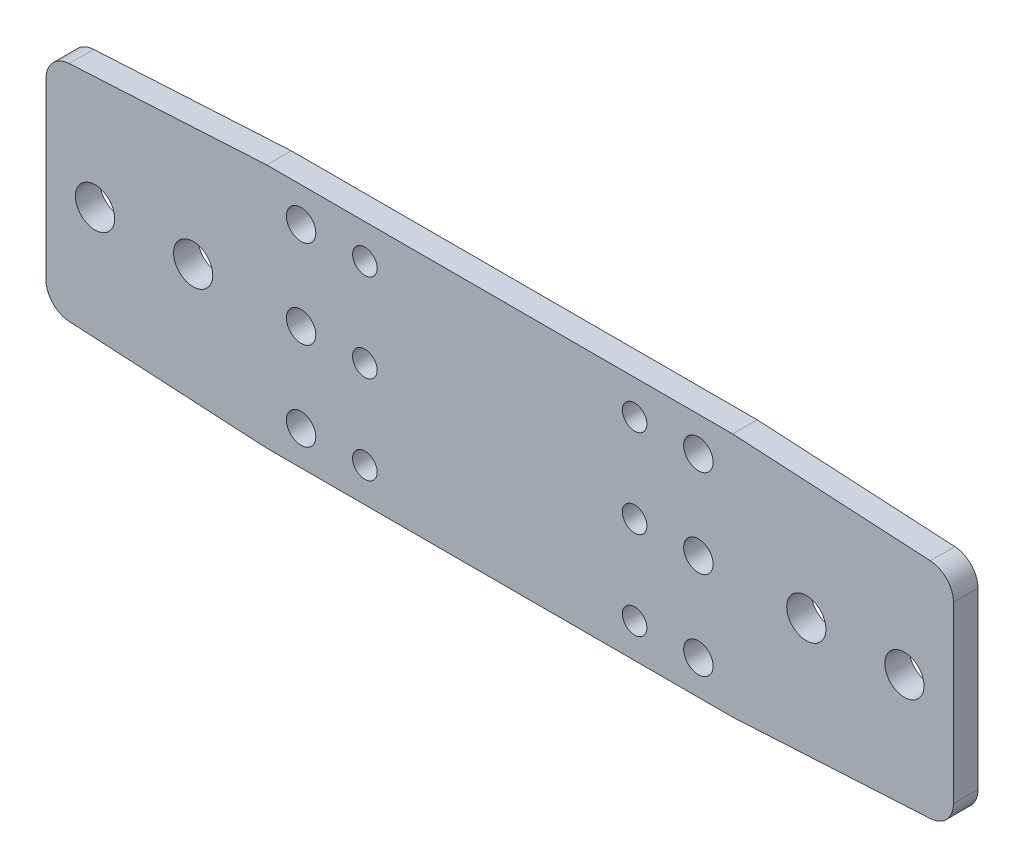
ISO-10303-21;
HEADER;
FILE_DESCRIPTION(('STEP AP214'),'2;1');
FILE_NAME('part.step','',(''),(''),'','','');
FILE_SCHEMA(('AUTOMOTIVE_DESIGN { 1 0 10303 214 1 1 1 1 }'));
ENDSEC;
DATA;
#1=APPLICATION_CONTEXT('core data for automotive mechanical design processes');
#2=APPLICATION_PROTOCOL_DEFINITION('international standard','automotive_design',2000,#1);
#3=PRODUCT_CONTEXT('',#1,'mechanical');
#4=PRODUCT('Part','Part','',(#3));
#5=PRODUCT_RELATED_PRODUCT_CATEGORY('part','',(#4));
#6=PRODUCT_DEFINITION_FORMATION('','',#4);
#7=PRODUCT_DEFINITION_CONTEXT('part definition',#1,'design');
#8=PRODUCT_DEFINITION('design','',#6,#7);
#9=PRODUCT_DEFINITION_SHAPE('','',#8);
#10=(LENGTH_UNIT() NAMED_UNIT(*) SI_UNIT(.MILLI.,.METRE.));
#11=(NAMED_UNIT(*) PLANE_ANGLE_UNIT() SI_UNIT($,.RADIAN.));
#12=(NAMED_UNIT(*) SI_UNIT($,.STERADIAN.) SOLID_ANGLE_UNIT());
#13=UNCERTAINTY_MEASURE_WITH_UNIT(LENGTH_MEASURE(1.E-05),#10,'distance_accuracy_value','');
#14=(GEOMETRIC_REPRESENTATION_CONTEXT(3) GLOBAL_UNCERTAINTY_ASSIGNED_CONTEXT((#13)) GLOBAL_UNIT_ASSIGNED_CONTEXT((#10,
#11,#12)) REPRESENTATION_CONTEXT('',''));
#15=CARTESIAN_POINT('',(0.,0.,0.));
#16=DIRECTION('',(0.,0.,1.));
#17=DIRECTION('',(1.,0.,0.));
#18=AXIS2_PLACEMENT_3D('',#15,#16,#17);
#19=CARTESIAN_POINT('',(0.,0.,5.));
#20=DIRECTION('',(0.,0.,-1.));
#21=DIRECTION('',(-1.,0.,0.));
#22=AXIS2_PLACEMENT_3D('',#19,#20,#21);
#23=PLANE('',#22);
#24=DIRECTION('',(0.,1.,0.));
#25=VECTOR('',#24,1.);
#26=CARTESIAN_POINT('',(140.,-47.5,5.));
#27=LINE('',#26,#25);
#28=CARTESIAN_POINT('',(140.,-42.7700676729667,5.));
#29=VERTEX_POINT('',#28);
#30=CARTESIAN_POINT('',(140.,-7.22993232703332,5.));
#31=VERTEX_POINT('',#30);
#32=EDGE_CURVE('E230',#29,#31,#27,.T.);
#33=ORIENTED_EDGE('',*,*,#32,.T.);
#34=CARTESIAN_POINT('',(135.,-7.22993232703331,5.));
#35=DIRECTION('',(0.,0.,-1.));
#36=DIRECTION('',(-1.,0.,0.));
#37=AXIS2_PLACEMENT_3D('',#34,#35,#36);
#38=CIRCLE('',#37,5.);
#39=CARTESIAN_POINT('',(135.277350098113,-2.23763056100624,5.));
#40=VERTEX_POINT('',#39);
#41=EDGE_CURVE('E141',#31,#40,#38,.F.);
#42=ORIENTED_EDGE('',*,*,#41,.T.);
#43=DIRECTION('',(-0.998460353205412,0.0554700196225229,0.));
#44=VECTOR('',#43,1.);
#45=CARTESIAN_POINT('',(140.,-2.49999999999999,5.));
#46=LINE('',#45,#44);
#47=CARTESIAN_POINT('',(95.,0.,5.));
#48=VERTEX_POINT('',#47);
#49=EDGE_CURVE('E133',#40,#48,#46,.T.);
#50=ORIENTED_EDGE('',*,*,#49,.T.);
#51=DIRECTION('',(-1.,0.,0.));
#52=VECTOR('',#51,1.);
#53=CARTESIAN_POINT('',(95.,0.,5.));
#54=LINE('',#53,#52);
#55=CARTESIAN_POINT('',(0.,0.,5.));
#56=VERTEX_POINT('',#55);
#57=EDGE_CURVE('E138',#48,#56,#54,.T.);
#58=ORIENTED_EDGE('',*,*,#57,.T.);
#59=DIRECTION('',(-0.998460353205412,-0.0554700196225231,0.));
#60=VECTOR('',#59,1.);
#61=CARTESIAN_POINT('',(-45.,-2.50000000000001,5.));
#62=LINE('',#61,#60);
#63=CARTESIAN_POINT('',(-40.2773500981126,-2.23763056100626,5.));
#64=VERTEX_POINT('',#63);
#65=EDGE_CURVE('E155',#56,#64,#62,.T.);
#66=ORIENTED_EDGE('',*,*,#65,.T.);
#67=CARTESIAN_POINT('',(-40.,-7.22993232703333,5.));
#68=DIRECTION('',(0.,0.,-1.));
#69=DIRECTION('',(-1.,0.,0.));
#70=AXIS2_PLACEMENT_3D('',#67,#68,#69);
#71=CIRCLE('',#70,5.);
#72=CARTESIAN_POINT('',(-45.,-7.22993232703334,5.));
#73=VERTEX_POINT('',#72);
#74=EDGE_CURVE('E182',#64,#73,#71,.F.);
#75=ORIENTED_EDGE('',*,*,#74,.T.);
#76=DIRECTION('',(0.,-1.,0.));
#77=VECTOR('',#76,1.);
#78=CARTESIAN_POINT('',(-45.,-47.5,5.));
#79=LINE('',#78,#77);
#80=CARTESIAN_POINT('',(-45.,-42.7700676729667,5.));
#81=VERTEX_POINT('',#80);
#82=EDGE_CURVE('E201',#73,#81,#79,.T.);
#83=ORIENTED_EDGE('',*,*,#82,.T.);
#84=CARTESIAN_POINT('',(-40.,-42.7700676729667,5.));
#85=DIRECTION('',(0.,0.,-1.));
#86=DIRECTION('',(-1.,0.,0.));
#87=AXIS2_PLACEMENT_3D('',#84,#85,#86);
#88=CIRCLE('',#87,5.);
#89=CARTESIAN_POINT('',(-40.2773500981126,-47.7623694389937,5.));
#90=VERTEX_POINT('',#89);
#91=EDGE_CURVE('E66',#81,#90,#88,.F.);
#92=ORIENTED_EDGE('',*,*,#91,.T.);
#93=DIRECTION('',(0.998460353205412,-0.055470019622523,0.));
#94=VECTOR('',#93,1.);
#95=CARTESIAN_POINT('',(-45.,-47.5,5.));
#96=LINE('',#95,#94);
#97=CARTESIAN_POINT('',(0.,-50.,5.));
#98=VERTEX_POINT('',#97);
#99=EDGE_CURVE('E522',#90,#98,#96,.T.);
#100=ORIENTED_EDGE('',*,*,#99,.T.);
#101=DIRECTION('',(1.,0.,0.));
#102=VECTOR('',#101,1.);
#103=CARTESIAN_POINT('',(0.,-50.,5.));
#104=LINE('',#103,#102);
#105=CARTESIAN_POINT('',(95.,-50.,5.));
#106=VERTEX_POINT('',#105);
#107=EDGE_CURVE('E238',#98,#106,#104,.T.);
#108=ORIENTED_EDGE('',*,*,#107,.T.);
#109=DIRECTION('',(0.998460353205412,0.0554700196225236,0.));
#110=VECTOR('',#109,1.);
#111=CARTESIAN_POINT('',(140.,-47.5,5.));
#112=LINE('',#111,#110);
#113=CARTESIAN_POINT('',(135.277350098113,-47.7623694389937,5.));
#114=VERTEX_POINT('',#113);
#115=EDGE_CURVE('E248',#106,#114,#112,.T.);
#116=ORIENTED_EDGE('',*,*,#115,.T.);
#117=CARTESIAN_POINT('',(135.,-42.7700676729667,5.));
#118=DIRECTION('',(0.,0.,-1.));
#119=DIRECTION('',(-1.,0.,0.));
#120=AXIS2_PLACEMENT_3D('',#117,#118,#119);
#121=CIRCLE('',#120,5.);
#122=EDGE_CURVE('E184',#114,#29,#121,.F.);
#123=ORIENTED_EDGE('',*,*,#122,.T.);
#124=EDGE_LOOP('',(#33,#42,#50,#58,#66,#75,#83,#92,#100,#108,#116,#123));
#125=FACE_BOUND('',#124,.T.);
#126=CARTESIAN_POINT('',(7.,-43.,5.));
#127=DIRECTION('',(0.,0.,1.));
#128=DIRECTION('',(1.,0.,0.));
#129=AXIS2_PLACEMENT_3D('',#126,#127,#128);
#130=CIRCLE('',#129,3.);
#131=CARTESIAN_POINT('',(10.,-43.,5.));
#132=VERTEX_POINT('',#131);
#133=EDGE_CURVE('E256',#132,#132,#130,.T.);
#134=ORIENTED_EDGE('',*,*,#133,.F.);
#135=EDGE_LOOP('',(#134));
#136=FACE_BOUND('',#135,.T.);
#137=CARTESIAN_POINT('',(7.,-25.,5.));
#138=DIRECTION('',(0.,0.,1.));
#139=DIRECTION('',(1.,0.,0.));
#140=AXIS2_PLACEMENT_3D('',#137,#138,#139);
#141=CIRCLE('',#140,3.);
#142=CARTESIAN_POINT('',(10.,-25.,5.));
#143=VERTEX_POINT('',#142);
#144=EDGE_CURVE('E529',#143,#143,#141,.T.);
#145=ORIENTED_EDGE('',*,*,#144,.F.);
#146=EDGE_LOOP('',(#145));
#147=FACE_BOUND('',#146,.T.);
#148=CARTESIAN_POINT('',(88.,-43.,5.));
#149=DIRECTION('',(0.,0.,1.));
#150=DIRECTION('',(1.,0.,0.));
#151=AXIS2_PLACEMENT_3D('',#148,#149,#150);
#152=CIRCLE('',#151,3.);
#153=CARTESIAN_POINT('',(91.,-43.,5.));
#154=VERTEX_POINT('',#153);
#155=EDGE_CURVE('E535',#154,#154,#152,.T.);
#156=ORIENTED_EDGE('',*,*,#155,.F.);
#157=EDGE_LOOP('',(#156));
#158=FACE_BOUND('',#157,.T.);
#159=CARTESIAN_POINT('',(88.,-7.,5.));
#160=DIRECTION('',(0.,0.,1.));
#161=DIRECTION('',(1.,0.,0.));
#162=AXIS2_PLACEMENT_3D('',#159,#160,#161);
#163=CIRCLE('',#162,3.);
#164=CARTESIAN_POINT('',(91.,-7.,5.));
#165=VERTEX_POINT('',#164);
#166=EDGE_CURVE('E541',#165,#165,#163,.T.);
#167=ORIENTED_EDGE('',*,*,#166,.F.);
#168=EDGE_LOOP('',(#167));
#169=FACE_BOUND('',#168,.T.);
#170=CARTESIAN_POINT('',(88.,-25.,5.));
#171=DIRECTION('',(0.,0.,1.));
#172=DIRECTION('',(1.,0.,0.));
#173=AXIS2_PLACEMENT_3D('',#170,#171,#172);
#174=CIRCLE('',#173,3.00000000000001);
#175=CARTESIAN_POINT('',(91.,-25.,5.));
#176=VERTEX_POINT('',#175);
#177=EDGE_CURVE('E547',#176,#176,#174,.T.);
#178=ORIENTED_EDGE('',*,*,#177,.F.);
#179=EDGE_LOOP('',(#178));
#180=FACE_BOUND('',#179,.T.);
#181=CARTESIAN_POINT('',(7.,-7.,5.));
#182=DIRECTION('',(0.,0.,1.));
#183=DIRECTION('',(1.,0.,0.));
#184=AXIS2_PLACEMENT_3D('',#181,#182,#183);
#185=CIRCLE('',#184,3.);
#186=CARTESIAN_POINT('',(10.,-7.,5.));
#187=VERTEX_POINT('',#186);
#188=EDGE_CURVE('E553',#187,#187,#185,.T.);
#189=ORIENTED_EDGE('',*,*,#188,.F.);
#190=EDGE_LOOP('',(#189));
#191=FACE_BOUND('',#190,.T.);
#192=CARTESIAN_POINT('',(20.,-7.,5.));
#193=DIRECTION('',(0.,0.,1.));
#194=DIRECTION('',(1.,0.,0.));
#195=AXIS2_PLACEMENT_3D('',#192,#193,#194);
#196=CIRCLE('',#195,2.5);
#197=CARTESIAN_POINT('',(22.5,-7.,5.));
#198=VERTEX_POINT('',#197);
#199=EDGE_CURVE('E559',#198,#198,#196,.T.);
#200=ORIENTED_EDGE('',*,*,#199,.F.);
#201=EDGE_LOOP('',(#200));
#202=FACE_BOUND('',#201,.T.);
#203=CARTESIAN_POINT('',(20.,-43.,5.));
#204=DIRECTION('',(0.,0.,1.));
#205=DIRECTION('',(1.,0.,0.));
#206=AXIS2_PLACEMENT_3D('',#203,#204,#205);
#207=CIRCLE('',#206,2.5);
#208=CARTESIAN_POINT('',(22.5,-43.,5.));
#209=VERTEX_POINT('',#208);
#210=EDGE_CURVE('E565',#209,#209,#207,.T.);
#211=ORIENTED_EDGE('',*,*,#210,.F.);
#212=EDGE_LOOP('',(#211));
#213=FACE_BOUND('',#212,.T.);
#214=CARTESIAN_POINT('',(-35.,-25.,5.));
#215=DIRECTION('',(0.,0.,1.));
#216=DIRECTION('',(1.,0.,0.));
#217=AXIS2_PLACEMENT_3D('',#214,#215,#216);
#218=CIRCLE('',#217,4.);
#219=CARTESIAN_POINT('',(-31.,-25.,5.));
#220=VERTEX_POINT('',#219);
#221=EDGE_CURVE('E571',#220,#220,#218,.T.);
#222=ORIENTED_EDGE('',*,*,#221,.F.);
#223=EDGE_LOOP('',(#222));
#224=FACE_BOUND('',#223,.T.);
#225=CARTESIAN_POINT('',(-15.,-25.,5.));
#226=DIRECTION('',(0.,0.,1.));
#227=DIRECTION('',(1.,0.,0.));
#228=AXIS2_PLACEMENT_3D('',#225,#226,#227);
#229=CIRCLE('',#228,4.);
#230=CARTESIAN_POINT('',(-11.,-25.,5.));
#231=VERTEX_POINT('',#230);
#232=EDGE_CURVE('E577',#231,#231,#229,.T.);
#233=ORIENTED_EDGE('',*,*,#232,.F.);
#234=EDGE_LOOP('',(#233));
#235=FACE_BOUND('',#234,.T.);
#236=CARTESIAN_POINT('',(75.,-43.,5.));
#237=DIRECTION('',(0.,0.,1.));
#238=DIRECTION('',(-1.,0.,0.));
#239=AXIS2_PLACEMENT_3D('',#236,#237,#238);
#240=CIRCLE('',#239,2.5);
#241=CARTESIAN_POINT('',(72.5,-43.,5.));
#242=VERTEX_POINT('',#241);
#243=EDGE_CURVE('E583',#242,#242,#240,.T.);
#244=ORIENTED_EDGE('',*,*,#243,.F.);
#245=EDGE_LOOP('',(#244));
#246=FACE_BOUND('',#245,.T.);
#247=CARTESIAN_POINT('',(75.,-7.00000000000001,5.));
#248=DIRECTION('',(0.,0.,1.));
#249=DIRECTION('',(-1.,0.,0.));
#250=AXIS2_PLACEMENT_3D('',#247,#248,#249);
#251=CIRCLE('',#250,2.49999999999999);
#252=CARTESIAN_POINT('',(72.5,-7.00000000000001,5.));
#253=VERTEX_POINT('',#252);
#254=EDGE_CURVE('E589',#253,#253,#251,.T.);
#255=ORIENTED_EDGE('',*,*,#254,.F.);
#256=EDGE_LOOP('',(#255));
#257=FACE_BOUND('',#256,.T.);
#258=CARTESIAN_POINT('',(110.,-25.,5.));
#259=DIRECTION('',(0.,0.,1.));
#260=DIRECTION('',(-1.,0.,0.));
#261=AXIS2_PLACEMENT_3D('',#258,#259,#260);
#262=CIRCLE('',#261,4.00000000000002);
#263=CARTESIAN_POINT('',(106.,-25.,5.));
#264=VERTEX_POINT('',#263);
#265=EDGE_CURVE('E595',#264,#264,#262,.T.);
#266=ORIENTED_EDGE('',*,*,#265,.F.);
#267=EDGE_LOOP('',(#266));
#268=FACE_BOUND('',#267,.T.);
#269=CARTESIAN_POINT('',(130.,-25.,5.));
#270=DIRECTION('',(0.,0.,1.));
#271=DIRECTION('',(-1.,0.,0.));
#272=AXIS2_PLACEMENT_3D('',#269,#270,#271);
#273=CIRCLE('',#272,3.99999999999999);
#274=CARTESIAN_POINT('',(126.,-25.,5.));
#275=VERTEX_POINT('',#274);
#276=EDGE_CURVE('E601',#275,#275,#273,.T.);
#277=ORIENTED_EDGE('',*,*,#276,.F.);
#278=EDGE_LOOP('',(#277));
#279=FACE_BOUND('',#278,.T.);
#280=CARTESIAN_POINT('',(20.,-25.,5.));
#281=DIRECTION('',(0.,0.,1.));
#282=DIRECTION('',(1.,0.,0.));
#283=AXIS2_PLACEMENT_3D('',#280,#281,#282);
#284=CIRCLE('',#283,2.5);
#285=CARTESIAN_POINT('',(22.5,-25.,5.));
#286=VERTEX_POINT('',#285);
#287=EDGE_CURVE('E607',#286,#286,#284,.T.);
#288=ORIENTED_EDGE('',*,*,#287,.F.);
#289=EDGE_LOOP('',(#288));
#290=FACE_BOUND('',#289,.T.);
#291=CARTESIAN_POINT('',(75.,-25.,5.));
#292=DIRECTION('',(0.,0.,1.));
#293=DIRECTION('',(1.,0.,0.));
#294=AXIS2_PLACEMENT_3D('',#291,#292,#293);
#295=CIRCLE('',#294,2.50000000000001);
#296=CARTESIAN_POINT('',(77.5,-25.,5.));
#297=VERTEX_POINT('',#296);
#298=EDGE_CURVE('E613',#297,#297,#295,.T.);
#299=ORIENTED_EDGE('',*,*,#298,.F.);
#300=EDGE_LOOP('',(#299));
#301=FACE_BOUND('',#300,.T.);
#302=ADVANCED_FACE('F43',(#125,#136,#147,#158,#169,#180,#191,#202,#213,#224,#235,#246,#257,#268,
#279,#290,#301),#23,.F.);
#303=CARTESIAN_POINT('',(0.,0.,0.));
#304=DIRECTION('',(0.,0.,-1.));
#305=DIRECTION('',(-1.,0.,0.));
#306=AXIS2_PLACEMENT_3D('',#303,#304,#305);
#307=PLANE('',#306);
#308=CARTESIAN_POINT('',(20.,-25.,0.));
#309=DIRECTION('',(0.,0.,1.));
#310=DIRECTION('',(1.,0.,0.));
#311=AXIS2_PLACEMENT_3D('',#308,#309,#310);
#312=CIRCLE('',#311,2.5);
#313=CARTESIAN_POINT('',(22.5,-25.,0.));
#314=VERTEX_POINT('',#313);
#315=EDGE_CURVE('E610',#314,#314,#312,.T.);
#316=ORIENTED_EDGE('',*,*,#315,.T.);
#317=EDGE_LOOP('',(#316));
#318=FACE_BOUND('',#317,.T.);
#319=CARTESIAN_POINT('',(110.,-25.,0.));
#320=DIRECTION('',(0.,0.,1.));
#321=DIRECTION('',(-1.,0.,0.));
#322=AXIS2_PLACEMENT_3D('',#319,#320,#321);
#323=CIRCLE('',#322,4.00000000000002);
#324=CARTESIAN_POINT('',(106.,-25.,0.));
#325=VERTEX_POINT('',#324);
#326=EDGE_CURVE('E598',#325,#325,#323,.T.);
#327=ORIENTED_EDGE('',*,*,#326,.T.);
#328=EDGE_LOOP('',(#327));
#329=FACE_BOUND('',#328,.T.);
#330=CARTESIAN_POINT('',(75.,-43.,0.));
#331=DIRECTION('',(0.,0.,1.));
#332=DIRECTION('',(-1.,0.,0.));
#333=AXIS2_PLACEMENT_3D('',#330,#331,#332);
#334=CIRCLE('',#333,2.5);
#335=CARTESIAN_POINT('',(72.5,-43.,0.));
#336=VERTEX_POINT('',#335);
#337=EDGE_CURVE('E586',#336,#336,#334,.T.);
#338=ORIENTED_EDGE('',*,*,#337,.T.);
#339=EDGE_LOOP('',(#338));
#340=FACE_BOUND('',#339,.T.);
#341=CARTESIAN_POINT('',(-35.,-25.,0.));
#342=DIRECTION('',(0.,0.,1.));
#343=DIRECTION('',(1.,0.,0.));
#344=AXIS2_PLACEMENT_3D('',#341,#342,#343);
#345=CIRCLE('',#344,4.);
#346=CARTESIAN_POINT('',(-31.,-25.,0.));
#347=VERTEX_POINT('',#346);
#348=EDGE_CURVE('E574',#347,#347,#345,.T.);
#349=ORIENTED_EDGE('',*,*,#348,.T.);
#350=EDGE_LOOP('',(#349));
#351=FACE_BOUND('',#350,.T.);
#352=CARTESIAN_POINT('',(20.,-7.,0.));
#353=DIRECTION('',(0.,0.,1.));
#354=DIRECTION('',(1.,0.,0.));
#355=AXIS2_PLACEMENT_3D('',#352,#353,#354);
#356=CIRCLE('',#355,2.5);
#357=CARTESIAN_POINT('',(22.5,-7.,0.));
#358=VERTEX_POINT('',#357);
#359=EDGE_CURVE('E562',#358,#358,#356,.T.);
#360=ORIENTED_EDGE('',*,*,#359,.T.);
#361=EDGE_LOOP('',(#360));
#362=FACE_BOUND('',#361,.T.);
#363=CARTESIAN_POINT('',(88.,-25.,0.));
#364=DIRECTION('',(0.,0.,1.));
#365=DIRECTION('',(1.,0.,0.));
#366=AXIS2_PLACEMENT_3D('',#363,#364,#365);
#367=CIRCLE('',#366,3.00000000000001);
#368=CARTESIAN_POINT('',(91.,-25.,0.));
#369=VERTEX_POINT('',#368);
#370=EDGE_CURVE('E550',#369,#369,#367,.T.);
#371=ORIENTED_EDGE('',*,*,#370,.T.);
#372=EDGE_LOOP('',(#371));
#373=FACE_BOUND('',#372,.T.);
#374=CARTESIAN_POINT('',(88.,-43.,0.));
#375=DIRECTION('',(0.,0.,1.));
#376=DIRECTION('',(1.,0.,0.));
#377=AXIS2_PLACEMENT_3D('',#374,#375,#376);
#378=CIRCLE('',#377,3.);
#379=CARTESIAN_POINT('',(91.,-43.,0.));
#380=VERTEX_POINT('',#379);
#381=EDGE_CURVE('E538',#380,#380,#378,.T.);
#382=ORIENTED_EDGE('',*,*,#381,.T.);
#383=EDGE_LOOP('',(#382));
#384=FACE_BOUND('',#383,.T.);
#385=CARTESIAN_POINT('',(7.,-43.,0.));
#386=DIRECTION('',(0.,0.,1.));
#387=DIRECTION('',(1.,0.,0.));
#388=AXIS2_PLACEMENT_3D('',#385,#386,#387);
#389=CIRCLE('',#388,3.);
#390=CARTESIAN_POINT('',(10.,-43.,0.));
#391=VERTEX_POINT('',#390);
#392=EDGE_CURVE('E526',#391,#391,#389,.T.);
#393=ORIENTED_EDGE('',*,*,#392,.T.);
#394=EDGE_LOOP('',(#393));
#395=FACE_BOUND('',#394,.T.);
#396=DIRECTION('',(-0.998460353205412,0.0554700196225229,0.));
#397=VECTOR('',#396,1.);
#398=CARTESIAN_POINT('',(140.,-2.49999999999999,0.));
#399=LINE('',#398,#397);
#400=CARTESIAN_POINT('',(135.277350098113,-2.23763056100624,0.));
#401=VERTEX_POINT('',#400);
#402=CARTESIAN_POINT('',(95.,0.,0.));
#403=VERTEX_POINT('',#402);
#404=EDGE_CURVE('E159',#401,#403,#399,.T.);
#405=ORIENTED_EDGE('',*,*,#404,.F.);
#406=CARTESIAN_POINT('',(135.,-7.22993232703331,0.));
#407=DIRECTION('',(0.,0.,-1.));
#408=DIRECTION('',(-1.,0.,0.));
#409=AXIS2_PLACEMENT_3D('',#406,#407,#408);
#410=CIRCLE('',#409,5.);
#411=CARTESIAN_POINT('',(140.,-7.22993232703332,0.));
#412=VERTEX_POINT('',#411);
#413=EDGE_CURVE('E174',#401,#412,#410,.T.);
#414=ORIENTED_EDGE('',*,*,#413,.T.);
#415=DIRECTION('',(0.,1.,0.));
#416=VECTOR('',#415,1.);
#417=CARTESIAN_POINT('',(140.,-47.5,0.));
#418=LINE('',#417,#416);
#419=CARTESIAN_POINT('',(140.,-42.7700676729667,0.));
#420=VERTEX_POINT('',#419);
#421=EDGE_CURVE('E146',#420,#412,#418,.T.);
#422=ORIENTED_EDGE('',*,*,#421,.F.);
#423=CARTESIAN_POINT('',(135.,-42.7700676729667,0.));
#424=DIRECTION('',(0.,0.,-1.));
#425=DIRECTION('',(-1.,0.,0.));
#426=AXIS2_PLACEMENT_3D('',#423,#424,#425);
#427=CIRCLE('',#426,5.);
#428=CARTESIAN_POINT('',(135.277350098113,-47.7623694389937,0.));
#429=VERTEX_POINT('',#428);
#430=EDGE_CURVE('E172',#420,#429,#427,.T.);
#431=ORIENTED_EDGE('',*,*,#430,.T.);
#432=DIRECTION('',(0.998460353205412,0.0554700196225236,0.));
#433=VECTOR('',#432,1.);
#434=CARTESIAN_POINT('',(140.,-47.5,0.));
#435=LINE('',#434,#433);
#436=CARTESIAN_POINT('',(95.,-50.,0.));
#437=VERTEX_POINT('',#436);
#438=EDGE_CURVE('E224',#437,#429,#435,.T.);
#439=ORIENTED_EDGE('',*,*,#438,.F.);
#440=DIRECTION('',(1.,0.,0.));
#441=VECTOR('',#440,1.);
#442=CARTESIAN_POINT('',(0.,-50.,0.));
#443=LINE('',#442,#441);
#444=CARTESIAN_POINT('',(0.,-50.,0.));
#445=VERTEX_POINT('',#444);
#446=EDGE_CURVE('E217',#445,#437,#443,.T.);
#447=ORIENTED_EDGE('',*,*,#446,.F.);
#448=DIRECTION('',(0.998460353205412,-0.055470019622523,0.));
#449=VECTOR('',#448,1.);
#450=CARTESIAN_POINT('',(-45.,-47.5,0.));
#451=LINE('',#450,#449);
#452=CARTESIAN_POINT('',(-40.2773500981126,-47.7623694389937,0.));
#453=VERTEX_POINT('',#452);
#454=EDGE_CURVE('E215',#453,#445,#451,.T.);
#455=ORIENTED_EDGE('',*,*,#454,.F.);
#456=CARTESIAN_POINT('',(-40.,-42.7700676729667,0.));
#457=DIRECTION('',(0.,0.,-1.));
#458=DIRECTION('',(-1.,0.,0.));
#459=AXIS2_PLACEMENT_3D('',#456,#457,#458);
#460=CIRCLE('',#459,5.);
#461=CARTESIAN_POINT('',(-45.,-42.7700676729667,0.));
#462=VERTEX_POINT('',#461);
#463=EDGE_CURVE('E163',#453,#462,#460,.T.);
#464=ORIENTED_EDGE('',*,*,#463,.T.);
#465=DIRECTION('',(0.,-1.,0.));
#466=VECTOR('',#465,1.);
#467=CARTESIAN_POINT('',(-45.,-47.5,0.));
#468=LINE('',#467,#466);
#469=CARTESIAN_POINT('',(-45.,-7.22993232703334,0.));
#470=VERTEX_POINT('',#469);
#471=EDGE_CURVE('E209',#470,#462,#468,.T.);
#472=ORIENTED_EDGE('',*,*,#471,.F.);
#473=CARTESIAN_POINT('',(-40.,-7.22993232703333,0.));
#474=DIRECTION('',(0.,0.,-1.));
#475=DIRECTION('',(-1.,0.,0.));
#476=AXIS2_PLACEMENT_3D('',#473,#474,#475);
#477=CIRCLE('',#476,5.);
#478=CARTESIAN_POINT('',(-40.2773500981126,-2.23763056100626,0.));
#479=VERTEX_POINT('',#478);
#480=EDGE_CURVE('E170',#470,#479,#477,.T.);
#481=ORIENTED_EDGE('',*,*,#480,.T.);
#482=DIRECTION('',(-0.998460353205412,-0.0554700196225231,0.));
#483=VECTOR('',#482,1.);
#484=CARTESIAN_POINT('',(-45.,-2.50000000000001,0.));
#485=LINE('',#484,#483);
#486=CARTESIAN_POINT('',(0.,0.,0.));
#487=VERTEX_POINT('',#486);
#488=EDGE_CURVE('E197',#487,#479,#485,.T.);
#489=ORIENTED_EDGE('',*,*,#488,.F.);
#490=DIRECTION('',(-1.,0.,0.));
#491=VECTOR('',#490,1.);
#492=CARTESIAN_POINT('',(95.,0.,0.));
#493=LINE('',#492,#491);
#494=EDGE_CURVE('E219',#403,#487,#493,.T.);
#495=ORIENTED_EDGE('',*,*,#494,.F.);
#496=EDGE_LOOP('',(#405,#414,#422,#431,#439,#447,#455,#464,#472,#481,#489,#495));
#497=FACE_BOUND('',#496,.T.);
#498=CARTESIAN_POINT('',(7.,-25.,0.));
#499=DIRECTION('',(0.,0.,1.));
#500=DIRECTION('',(1.,0.,0.));
#501=AXIS2_PLACEMENT_3D('',#498,#499,#500);
#502=CIRCLE('',#501,3.);
#503=CARTESIAN_POINT('',(10.,-25.,0.));
#504=VERTEX_POINT('',#503);
#505=EDGE_CURVE('E532',#504,#504,#502,.T.);
#506=ORIENTED_EDGE('',*,*,#505,.T.);
#507=EDGE_LOOP('',(#506));
#508=FACE_BOUND('',#507,.T.);
#509=CARTESIAN_POINT('',(88.,-7.,0.));
#510=DIRECTION('',(0.,0.,1.));
#511=DIRECTION('',(1.,0.,0.));
#512=AXIS2_PLACEMENT_3D('',#509,#510,#511);
#513=CIRCLE('',#512,3.);
#514=CARTESIAN_POINT('',(91.,-7.,0.));
#515=VERTEX_POINT('',#514);
#516=EDGE_CURVE('E544',#515,#515,#513,.T.);
#517=ORIENTED_EDGE('',*,*,#516,.T.);
#518=EDGE_LOOP('',(#517));
#519=FACE_BOUND('',#518,.T.);
#520=CARTESIAN_POINT('',(7.,-7.,0.));
#521=DIRECTION('',(0.,0.,1.));
#522=DIRECTION('',(1.,0.,0.));
#523=AXIS2_PLACEMENT_3D('',#520,#521,#522);
#524=CIRCLE('',#523,3.);
#525=CARTESIAN_POINT('',(10.,-7.,0.));
#526=VERTEX_POINT('',#525);
#527=EDGE_CURVE('E556',#526,#526,#524,.T.);
#528=ORIENTED_EDGE('',*,*,#527,.T.);
#529=EDGE_LOOP('',(#528));
#530=FACE_BOUND('',#529,.T.);
#531=CARTESIAN_POINT('',(20.,-43.,0.));
#532=DIRECTION('',(0.,0.,1.));
#533=DIRECTION('',(1.,0.,0.));
#534=AXIS2_PLACEMENT_3D('',#531,#532,#533);
#535=CIRCLE('',#534,2.5);
#536=CARTESIAN_POINT('',(22.5,-43.,0.));
#537=VERTEX_POINT('',#536);
#538=EDGE_CURVE('E568',#537,#537,#535,.T.);
#539=ORIENTED_EDGE('',*,*,#538,.T.);
#540=EDGE_LOOP('',(#539));
#541=FACE_BOUND('',#540,.T.);
#542=CARTESIAN_POINT('',(-15.,-25.,0.));
#543=DIRECTION('',(0.,0.,1.));
#544=DIRECTION('',(1.,0.,0.));
#545=AXIS2_PLACEMENT_3D('',#542,#543,#544);
#546=CIRCLE('',#545,4.);
#547=CARTESIAN_POINT('',(-11.,-25.,0.));
#548=VERTEX_POINT('',#547);
#549=EDGE_CURVE('E580',#548,#548,#546,.T.);
#550=ORIENTED_EDGE('',*,*,#549,.T.);
#551=EDGE_LOOP('',(#550));
#552=FACE_BOUND('',#551,.T.);
#553=CARTESIAN_POINT('',(75.,-7.00000000000001,0.));
#554=DIRECTION('',(0.,0.,1.));
#555=DIRECTION('',(-1.,0.,0.));
#556=AXIS2_PLACEMENT_3D('',#553,#554,#555);
#557=CIRCLE('',#556,2.49999999999999);
#558=CARTESIAN_POINT('',(72.5,-7.00000000000001,0.));
#559=VERTEX_POINT('',#558);
#560=EDGE_CURVE('E592',#559,#559,#557,.T.);
#561=ORIENTED_EDGE('',*,*,#560,.T.);
#562=EDGE_LOOP('',(#561));
#563=FACE_BOUND('',#562,.T.);
#564=CARTESIAN_POINT('',(130.,-25.,0.));
#565=DIRECTION('',(0.,0.,1.));
#566=DIRECTION('',(-1.,0.,0.));
#567=AXIS2_PLACEMENT_3D('',#564,#565,#566);
#568=CIRCLE('',#567,3.99999999999999);
#569=CARTESIAN_POINT('',(126.,-25.,0.));
#570=VERTEX_POINT('',#569);
#571=EDGE_CURVE('E604',#570,#570,#568,.T.);
#572=ORIENTED_EDGE('',*,*,#571,.T.);
#573=EDGE_LOOP('',(#572));
#574=FACE_BOUND('',#573,.T.);
#575=CARTESIAN_POINT('',(75.,-25.,0.));
#576=DIRECTION('',(0.,0.,1.));
#577=DIRECTION('',(1.,0.,0.));
#578=AXIS2_PLACEMENT_3D('',#575,#576,#577);
#579=CIRCLE('',#578,2.50000000000001);
#580=CARTESIAN_POINT('',(77.5,-25.,0.));
#581=VERTEX_POINT('',#580);
#582=EDGE_CURVE('E616',#581,#581,#579,.T.);
#583=ORIENTED_EDGE('',*,*,#582,.T.);
#584=EDGE_LOOP('',(#583));
#585=FACE_BOUND('',#584,.T.);
#586=ADVANCED_FACE('F212',(#318,#329,#340,#351,#362,#373,#384,#395,#497,#508,#519,#530,#541,
#552,#563,#574,#585),#307,.T.);
#587=CARTESIAN_POINT('',(140.,-2.49999999999999,5.));
#588=DIRECTION('',(-0.0554700196225229,-0.998460353205412,0.));
#589=DIRECTION('',(0.998460353205412,-0.0554700196225229,0.));
#590=AXIS2_PLACEMENT_3D('',#587,#588,#589);
#591=PLANE('',#590);
#592=ORIENTED_EDGE('',*,*,#49,.F.);
#593=DIRECTION('',(0.,0.,-1.));
#594=VECTOR('',#593,1.);
#595=CARTESIAN_POINT('',(135.277350098113,-2.23763056100624,5.));
#596=LINE('',#595,#594);
#597=EDGE_CURVE('E161',#40,#401,#596,.T.);
#598=ORIENTED_EDGE('',*,*,#597,.T.);
#599=ORIENTED_EDGE('',*,*,#404,.T.);
#600=DIRECTION('',(0.,0.,-1.));
#601=VECTOR('',#600,1.);
#602=CARTESIAN_POINT('',(95.,0.,5.));
#603=LINE('',#602,#601);
#604=EDGE_CURVE('E151',#48,#403,#603,.T.);
#605=ORIENTED_EDGE('',*,*,#604,.F.);
#606=EDGE_LOOP('',(#592,#598,#599,#605));
#607=FACE_BOUND('',#606,.T.);
#608=ADVANCED_FACE('F157',(#607),#591,.F.);
#609=CARTESIAN_POINT('',(95.,0.,5.));
#610=DIRECTION('',(0.,-1.,0.));
#611=DIRECTION('',(1.,0.,0.));
#612=AXIS2_PLACEMENT_3D('',#609,#610,#611);
#613=PLANE('',#612);
#614=ORIENTED_EDGE('',*,*,#494,.T.);
#615=DIRECTION('',(0.,0.,-1.));
#616=VECTOR('',#615,1.);
#617=CARTESIAN_POINT('',(0.,0.,5.));
#618=LINE('',#617,#616);
#619=EDGE_CURVE('E153',#56,#487,#618,.T.);
#620=ORIENTED_EDGE('',*,*,#619,.F.);
#621=ORIENTED_EDGE('',*,*,#57,.F.);
#622=ORIENTED_EDGE('',*,*,#604,.T.);
#623=EDGE_LOOP('',(#614,#620,#621,#622));
#624=FACE_BOUND('',#623,.T.);
#625=ADVANCED_FACE('F150',(#624),#613,.F.);
#626=CARTESIAN_POINT('',(-45.,-2.50000000000001,5.));
#627=DIRECTION('',(0.0554700196225231,-0.998460353205412,0.));
#628=DIRECTION('',(0.998460353205412,0.0554700196225231,0.));
#629=AXIS2_PLACEMENT_3D('',#626,#627,#628);
#630=PLANE('',#629);
#631=ORIENTED_EDGE('',*,*,#488,.T.);
#632=DIRECTION('',(0.,0.,-1.));
#633=VECTOR('',#632,1.);
#634=CARTESIAN_POINT('',(-40.2773500981126,-2.23763056100626,5.));
#635=LINE('',#634,#633);
#636=EDGE_CURVE('E51',#479,#64,#635,.F.);
#637=ORIENTED_EDGE('',*,*,#636,.T.);
#638=ORIENTED_EDGE('',*,*,#65,.F.);
#639=ORIENTED_EDGE('',*,*,#619,.T.);
#640=EDGE_LOOP('',(#631,#637,#638,#639));
#641=FACE_BOUND('',#640,.T.);
#642=ADVANCED_FACE('F195',(#641),#630,.F.);
#643=CARTESIAN_POINT('',(-45.,-47.5,5.));
#644=DIRECTION('',(1.,0.,0.));
#645=DIRECTION('',(0.,1.,0.));
#646=AXIS2_PLACEMENT_3D('',#643,#644,#645);
#647=PLANE('',#646);
#648=ORIENTED_EDGE('',*,*,#82,.F.);
#649=DIRECTION('',(0.,0.,-1.));
#650=VECTOR('',#649,1.);
#651=CARTESIAN_POINT('',(-45.,-7.22993232703333,5.));
#652=LINE('',#651,#650);
#653=EDGE_CURVE('E190',#73,#470,#652,.T.);
#654=ORIENTED_EDGE('',*,*,#653,.T.);
#655=ORIENTED_EDGE('',*,*,#471,.T.);
#656=DIRECTION('',(0.,0.,-1.));
#657=VECTOR('',#656,1.);
#658=CARTESIAN_POINT('',(-45.,-42.7700676729667,5.));
#659=LINE('',#658,#657);
#660=EDGE_CURVE('E188',#462,#81,#659,.F.);
#661=ORIENTED_EDGE('',*,*,#660,.T.);
#662=EDGE_LOOP('',(#648,#654,#655,#661));
#663=FACE_BOUND('',#662,.T.);
#664=ADVANCED_FACE('F208',(#663),#647,.F.);
#665=CARTESIAN_POINT('',(-45.,-47.5,5.));
#666=DIRECTION('',(0.055470019622523,0.998460353205412,0.));
#667=DIRECTION('',(-0.998460353205412,0.055470019622523,0.));
#668=AXIS2_PLACEMENT_3D('',#665,#666,#667);
#669=PLANE('',#668);
#670=ORIENTED_EDGE('',*,*,#99,.F.);
#671=DIRECTION('',(0.,0.,-1.));
#672=VECTOR('',#671,1.);
#673=CARTESIAN_POINT('',(-40.2773500981126,-47.7623694389937,5.));
#674=LINE('',#673,#672);
#675=EDGE_CURVE('E11',#90,#453,#674,.T.);
#676=ORIENTED_EDGE('',*,*,#675,.T.);
#677=ORIENTED_EDGE('',*,*,#454,.T.);
#678=DIRECTION('',(0.,0.,-1.));
#679=VECTOR('',#678,1.);
#680=CARTESIAN_POINT('',(0.,-50.,5.));
#681=LINE('',#680,#679);
#682=EDGE_CURVE('E165',#98,#445,#681,.T.);
#683=ORIENTED_EDGE('',*,*,#682,.F.);
#684=EDGE_LOOP('',(#670,#676,#677,#683));
#685=FACE_BOUND('',#684,.T.);
#686=ADVANCED_FACE('F288',(#685),#669,.F.);
#687=CARTESIAN_POINT('',(0.,-50.,5.));
#688=DIRECTION('',(0.,1.,0.));
#689=DIRECTION('',(-1.,0.,0.));
#690=AXIS2_PLACEMENT_3D('',#687,#688,#689);
#691=PLANE('',#690);
#692=ORIENTED_EDGE('',*,*,#446,.T.);
#693=DIRECTION('',(0.,0.,-1.));
#694=VECTOR('',#693,1.);
#695=CARTESIAN_POINT('',(95.,-50.,5.));
#696=LINE('',#695,#694);
#697=EDGE_CURVE('E228',#106,#437,#696,.T.);
#698=ORIENTED_EDGE('',*,*,#697,.F.);
#699=ORIENTED_EDGE('',*,*,#107,.F.);
#700=ORIENTED_EDGE('',*,*,#682,.T.);
#701=EDGE_LOOP('',(#692,#698,#699,#700));
#702=FACE_BOUND('',#701,.T.);
#703=ADVANCED_FACE('F236',(#702),#691,.F.);
#704=CARTESIAN_POINT('',(140.,-47.5,5.));
#705=DIRECTION('',(-0.0554700196225236,0.998460353205412,0.));
#706=DIRECTION('',(-0.998460353205412,-0.0554700196225236,0.));
#707=AXIS2_PLACEMENT_3D('',#704,#705,#706);
#708=PLANE('',#707);
#709=ORIENTED_EDGE('',*,*,#438,.T.);
#710=DIRECTION('',(0.,0.,-1.));
#711=VECTOR('',#710,1.);
#712=CARTESIAN_POINT('',(135.277350098113,-47.7623694389937,5.));
#713=LINE('',#712,#711);
#714=EDGE_CURVE('E58',#429,#114,#713,.F.);
#715=ORIENTED_EDGE('',*,*,#714,.T.);
#716=ORIENTED_EDGE('',*,*,#115,.F.);
#717=ORIENTED_EDGE('',*,*,#697,.T.);
#718=EDGE_LOOP('',(#709,#715,#716,#717));
#719=FACE_BOUND('',#718,.T.);
#720=ADVANCED_FACE('F242',(#719),#708,.F.);
#721=CARTESIAN_POINT('',(140.,-47.5,5.));
#722=DIRECTION('',(-1.,0.,0.));
#723=DIRECTION('',(0.,0.,1.));
#724=AXIS2_PLACEMENT_3D('',#721,#722,#723);
#725=PLANE('',#724);
#726=ORIENTED_EDGE('',*,*,#421,.T.);
#727=DIRECTION('',(0.,0.,-1.));
#728=VECTOR('',#727,1.);
#729=CARTESIAN_POINT('',(140.,-7.2299323270333,5.));
#730=LINE('',#729,#728);
#731=EDGE_CURVE('E179',#412,#31,#730,.F.);
#732=ORIENTED_EDGE('',*,*,#731,.T.);
#733=ORIENTED_EDGE('',*,*,#32,.F.);
#734=DIRECTION('',(0.,0.,-1.));
#735=VECTOR('',#734,1.);
#736=CARTESIAN_POINT('',(140.,-42.7700676729667,5.));
#737=LINE('',#736,#735);
#738=EDGE_CURVE('E176',#29,#420,#737,.T.);
#739=ORIENTED_EDGE('',*,*,#738,.T.);
#740=EDGE_LOOP('',(#726,#732,#733,#739));
#741=FACE_BOUND('',#740,.T.);
#742=ADVANCED_FACE('F250',(#741),#725,.F.);
#743=CARTESIAN_POINT('',(7.,-43.,5.));
#744=DIRECTION('',(0.,0.,-1.));
#745=DIRECTION('',(-1.,0.,0.));
#746=AXIS2_PLACEMENT_3D('',#743,#744,#745);
#747=CYLINDRICAL_SURFACE('',#746,3.);
#748=ORIENTED_EDGE('',*,*,#392,.F.);
#749=EDGE_LOOP('',(#748));
#750=FACE_BOUND('',#749,.T.);
#751=ORIENTED_EDGE('',*,*,#133,.T.);
#752=EDGE_LOOP('',(#751));
#753=FACE_BOUND('',#752,.T.);
#754=ADVANCED_FACE('F280',(#750,#753),#747,.F.);
#755=CARTESIAN_POINT('',(7.,-25.,5.));
#756=DIRECTION('',(0.,0.,-1.));
#757=DIRECTION('',(-1.,0.,0.));
#758=AXIS2_PLACEMENT_3D('',#755,#756,#757);
#759=CYLINDRICAL_SURFACE('',#758,3.);
#760=ORIENTED_EDGE('',*,*,#144,.T.);
#761=EDGE_LOOP('',(#760));
#762=FACE_BOUND('',#761,.T.);
#763=ORIENTED_EDGE('',*,*,#505,.F.);
#764=EDGE_LOOP('',(#763));
#765=FACE_BOUND('',#764,.T.);
#766=ADVANCED_FACE('F338',(#762,#765),#759,.F.);
#767=CARTESIAN_POINT('',(88.,-43.,5.));
#768=DIRECTION('',(0.,0.,-1.));
#769=DIRECTION('',(-1.,0.,0.));
#770=AXIS2_PLACEMENT_3D('',#767,#768,#769);
#771=CYLINDRICAL_SURFACE('',#770,3.);
#772=ORIENTED_EDGE('',*,*,#381,.F.);
#773=EDGE_LOOP('',(#772));
#774=FACE_BOUND('',#773,.T.);
#775=ORIENTED_EDGE('',*,*,#155,.T.);
#776=EDGE_LOOP('',(#775));
#777=FACE_BOUND('',#776,.T.);
#778=ADVANCED_FACE('F350',(#774,#777),#771,.F.);
#779=CARTESIAN_POINT('',(88.,-7.,5.));
#780=DIRECTION('',(0.,0.,-1.));
#781=DIRECTION('',(-1.,0.,0.));
#782=AXIS2_PLACEMENT_3D('',#779,#780,#781);
#783=CYLINDRICAL_SURFACE('',#782,3.);
#784=ORIENTED_EDGE('',*,*,#516,.F.);
#785=EDGE_LOOP('',(#784));
#786=FACE_BOUND('',#785,.T.);
#787=ORIENTED_EDGE('',*,*,#166,.T.);
#788=EDGE_LOOP('',(#787));
#789=FACE_BOUND('',#788,.T.);
#790=ADVANCED_FACE('F359',(#786,#789),#783,.F.);
#791=CARTESIAN_POINT('',(88.,-25.,5.));
#792=DIRECTION('',(0.,0.,-1.));
#793=DIRECTION('',(-1.,0.,0.));
#794=AXIS2_PLACEMENT_3D('',#791,#792,#793);
#795=CYLINDRICAL_SURFACE('',#794,3.00000000000001);
#796=ORIENTED_EDGE('',*,*,#177,.T.);
#797=EDGE_LOOP('',(#796));
#798=FACE_BOUND('',#797,.T.);
#799=ORIENTED_EDGE('',*,*,#370,.F.);
#800=EDGE_LOOP('',(#799));
#801=FACE_BOUND('',#800,.T.);
#802=ADVANCED_FACE('F372',(#798,#801),#795,.F.);
#803=CARTESIAN_POINT('',(7.,-7.,5.));
#804=DIRECTION('',(0.,0.,-1.));
#805=DIRECTION('',(-1.,0.,0.));
#806=AXIS2_PLACEMENT_3D('',#803,#804,#805);
#807=CYLINDRICAL_SURFACE('',#806,3.);
#808=ORIENTED_EDGE('',*,*,#527,.F.);
#809=EDGE_LOOP('',(#808));
#810=FACE_BOUND('',#809,.T.);
#811=ORIENTED_EDGE('',*,*,#188,.T.);
#812=EDGE_LOOP('',(#811));
#813=FACE_BOUND('',#812,.T.);
#814=ADVANCED_FACE('F385',(#810,#813),#807,.F.);
#815=CARTESIAN_POINT('',(20.,-7.,5.));
#816=DIRECTION('',(0.,0.,-1.));
#817=DIRECTION('',(-1.,0.,0.));
#818=AXIS2_PLACEMENT_3D('',#815,#816,#817);
#819=CYLINDRICAL_SURFACE('',#818,2.5);
#820=ORIENTED_EDGE('',*,*,#199,.T.);
#821=EDGE_LOOP('',(#820));
#822=FACE_BOUND('',#821,.T.);
#823=ORIENTED_EDGE('',*,*,#359,.F.);
#824=EDGE_LOOP('',(#823));
#825=FACE_BOUND('',#824,.T.);
#826=ADVANCED_FACE('F395',(#822,#825),#819,.F.);
#827=CARTESIAN_POINT('',(20.,-43.,5.));
#828=DIRECTION('',(0.,0.,-1.));
#829=DIRECTION('',(-1.,0.,0.));
#830=AXIS2_PLACEMENT_3D('',#827,#828,#829);
#831=CYLINDRICAL_SURFACE('',#830,2.5);
#832=ORIENTED_EDGE('',*,*,#210,.T.);
#833=EDGE_LOOP('',(#832));
#834=FACE_BOUND('',#833,.T.);
#835=ORIENTED_EDGE('',*,*,#538,.F.);
#836=EDGE_LOOP('',(#835));
#837=FACE_BOUND('',#836,.T.);
#838=ADVANCED_FACE('F408',(#834,#837),#831,.F.);
#839=CARTESIAN_POINT('',(-35.,-25.,5.));
#840=DIRECTION('',(0.,0.,-1.));
#841=DIRECTION('',(-1.,0.,0.));
#842=AXIS2_PLACEMENT_3D('',#839,#840,#841);
#843=CYLINDRICAL_SURFACE('',#842,4.);
#844=ORIENTED_EDGE('',*,*,#221,.T.);
#845=EDGE_LOOP('',(#844));
#846=FACE_BOUND('',#845,.T.);
#847=ORIENTED_EDGE('',*,*,#348,.F.);
#848=EDGE_LOOP('',(#847));
#849=FACE_BOUND('',#848,.T.);
#850=ADVANCED_FACE('F418',(#846,#849),#843,.F.);
#851=CARTESIAN_POINT('',(-15.,-25.,5.));
#852=DIRECTION('',(0.,0.,-1.));
#853=DIRECTION('',(-1.,0.,0.));
#854=AXIS2_PLACEMENT_3D('',#851,#852,#853);
#855=CYLINDRICAL_SURFACE('',#854,4.);
#856=ORIENTED_EDGE('',*,*,#232,.T.);
#857=EDGE_LOOP('',(#856));
#858=FACE_BOUND('',#857,.T.);
#859=ORIENTED_EDGE('',*,*,#549,.F.);
#860=EDGE_LOOP('',(#859));
#861=FACE_BOUND('',#860,.T.);
#862=ADVANCED_FACE('F428',(#858,#861),#855,.F.);
#863=CARTESIAN_POINT('',(75.,-43.,5.));
#864=DIRECTION('',(0.,0.,-1.));
#865=DIRECTION('',(-1.,0.,0.));
#866=AXIS2_PLACEMENT_3D('',#863,#864,#865);
#867=CYLINDRICAL_SURFACE('',#866,2.5);
#868=ORIENTED_EDGE('',*,*,#243,.T.);
#869=EDGE_LOOP('',(#868));
#870=FACE_BOUND('',#869,.T.);
#871=ORIENTED_EDGE('',*,*,#337,.F.);
#872=EDGE_LOOP('',(#871));
#873=FACE_BOUND('',#872,.T.);
#874=ADVANCED_FACE('F438',(#870,#873),#867,.F.);
#875=CARTESIAN_POINT('',(75.,-7.00000000000001,5.));
#876=DIRECTION('',(0.,0.,-1.));
#877=DIRECTION('',(-1.,0.,0.));
#878=AXIS2_PLACEMENT_3D('',#875,#876,#877);
#879=CYLINDRICAL_SURFACE('',#878,2.49999999999999);
#880=ORIENTED_EDGE('',*,*,#254,.T.);
#881=EDGE_LOOP('',(#880));
#882=FACE_BOUND('',#881,.T.);
#883=ORIENTED_EDGE('',*,*,#560,.F.);
#884=EDGE_LOOP('',(#883));
#885=FACE_BOUND('',#884,.T.);
#886=ADVANCED_FACE('F448',(#882,#885),#879,.F.);
#887=CARTESIAN_POINT('',(110.,-25.,5.));
#888=DIRECTION('',(0.,0.,-1.));
#889=DIRECTION('',(-1.,0.,0.));
#890=AXIS2_PLACEMENT_3D('',#887,#888,#889);
#891=CYLINDRICAL_SURFACE('',#890,4.00000000000002);
#892=ORIENTED_EDGE('',*,*,#265,.T.);
#893=EDGE_LOOP('',(#892));
#894=FACE_BOUND('',#893,.T.);
#895=ORIENTED_EDGE('',*,*,#326,.F.);
#896=EDGE_LOOP('',(#895));
#897=FACE_BOUND('',#896,.T.);
#898=ADVANCED_FACE('F458',(#894,#897),#891,.F.);
#899=CARTESIAN_POINT('',(130.,-25.,5.));
#900=DIRECTION('',(0.,0.,-1.));
#901=DIRECTION('',(-1.,0.,0.));
#902=AXIS2_PLACEMENT_3D('',#899,#900,#901);
#903=CYLINDRICAL_SURFACE('',#902,3.99999999999999);
#904=ORIENTED_EDGE('',*,*,#276,.T.);
#905=EDGE_LOOP('',(#904));
#906=FACE_BOUND('',#905,.T.);
#907=ORIENTED_EDGE('',*,*,#571,.F.);
#908=EDGE_LOOP('',(#907));
#909=FACE_BOUND('',#908,.T.);
#910=ADVANCED_FACE('F468',(#906,#909),#903,.F.);
#911=CARTESIAN_POINT('',(20.,-25.,5.));
#912=DIRECTION('',(0.,0.,-1.));
#913=DIRECTION('',(-1.,0.,0.));
#914=AXIS2_PLACEMENT_3D('',#911,#912,#913);
#915=CYLINDRICAL_SURFACE('',#914,2.5);
#916=ORIENTED_EDGE('',*,*,#287,.T.);
#917=EDGE_LOOP('',(#916));
#918=FACE_BOUND('',#917,.T.);
#919=ORIENTED_EDGE('',*,*,#315,.F.);
#920=EDGE_LOOP('',(#919));
#921=FACE_BOUND('',#920,.T.);
#922=ADVANCED_FACE('F268',(#918,#921),#915,.F.);
#923=CARTESIAN_POINT('',(75.,-25.,5.));
#924=DIRECTION('',(0.,0.,-1.));
#925=DIRECTION('',(-1.,0.,0.));
#926=AXIS2_PLACEMENT_3D('',#923,#924,#925);
#927=CYLINDRICAL_SURFACE('',#926,2.50000000000001);
#928=ORIENTED_EDGE('',*,*,#298,.T.);
#929=EDGE_LOOP('',(#928));
#930=FACE_BOUND('',#929,.T.);
#931=ORIENTED_EDGE('',*,*,#582,.F.);
#932=EDGE_LOOP('',(#931));
#933=FACE_BOUND('',#932,.T.);
#934=ADVANCED_FACE('F260',(#930,#933),#927,.F.);
#935=CARTESIAN_POINT('',(135.,-7.22993232703331,5.));
#936=DIRECTION('',(0.,0.,-1.));
#937=DIRECTION('',(-1.,0.,0.));
#938=AXIS2_PLACEMENT_3D('',#935,#936,#937);
#939=CYLINDRICAL_SURFACE('',#938,5.);
#940=ORIENTED_EDGE('',*,*,#41,.F.);
#941=ORIENTED_EDGE('',*,*,#731,.F.);
#942=ORIENTED_EDGE('',*,*,#413,.F.);
#943=ORIENTED_EDGE('',*,*,#597,.F.);
#944=EDGE_LOOP('',(#940,#941,#942,#943));
#945=FACE_BOUND('',#944,.T.);
#946=ADVANCED_FACE('F258',(#945),#939,.T.);
#947=CARTESIAN_POINT('',(135.,-42.7700676729667,5.));
#948=DIRECTION('',(0.,0.,-1.));
#949=DIRECTION('',(-1.,0.,0.));
#950=AXIS2_PLACEMENT_3D('',#947,#948,#949);
#951=CYLINDRICAL_SURFACE('',#950,5.);
#952=ORIENTED_EDGE('',*,*,#122,.F.);
#953=ORIENTED_EDGE('',*,*,#714,.F.);
#954=ORIENTED_EDGE('',*,*,#430,.F.);
#955=ORIENTED_EDGE('',*,*,#738,.F.);
#956=EDGE_LOOP('',(#952,#953,#954,#955));
#957=FACE_BOUND('',#956,.T.);
#958=ADVANCED_FACE('F245',(#957),#951,.T.);
#959=CARTESIAN_POINT('',(-40.,-7.22993232703333,5.));
#960=DIRECTION('',(0.,0.,-1.));
#961=DIRECTION('',(-1.,0.,0.));
#962=AXIS2_PLACEMENT_3D('',#959,#960,#961);
#963=CYLINDRICAL_SURFACE('',#962,5.);
#964=ORIENTED_EDGE('',*,*,#74,.F.);
#965=ORIENTED_EDGE('',*,*,#636,.F.);
#966=ORIENTED_EDGE('',*,*,#480,.F.);
#967=ORIENTED_EDGE('',*,*,#653,.F.);
#968=EDGE_LOOP('',(#964,#965,#966,#967));
#969=FACE_BOUND('',#968,.T.);
#970=ADVANCED_FACE('F204',(#969),#963,.T.);
#971=CARTESIAN_POINT('',(-40.,-42.7700676729667,5.));
#972=DIRECTION('',(0.,0.,-1.));
#973=DIRECTION('',(-1.,0.,0.));
#974=AXIS2_PLACEMENT_3D('',#971,#972,#973);
#975=CYLINDRICAL_SURFACE('',#974,5.);
#976=ORIENTED_EDGE('',*,*,#91,.F.);
#977=ORIENTED_EDGE('',*,*,#660,.F.);
#978=ORIENTED_EDGE('',*,*,#463,.F.);
#979=ORIENTED_EDGE('',*,*,#675,.F.);
#980=EDGE_LOOP('',(#976,#977,#978,#979));
#981=FACE_BOUND('',#980,.T.);
#982=ADVANCED_FACE('F45',(#981),#975,.T.);
#983=CLOSED_SHELL('',(#302,#586,#608,#625,#642,#664,#686,#703,#720,#742,#754,#766,#778,#790,
#802,#814,#826,#838,#850,#862,#874,#886,#898,#910,#922,#934,#946,#958,#970,#982));
#984=MANIFOLD_SOLID_BREP('B2',#983);
#985=ADVANCED_BREP_SHAPE_REPRESENTATION('',(#18,#984),#14);
#986=SHAPE_DEFINITION_REPRESENTATION(#9,#985);
ENDSEC;
END-ISO-10303-21;
